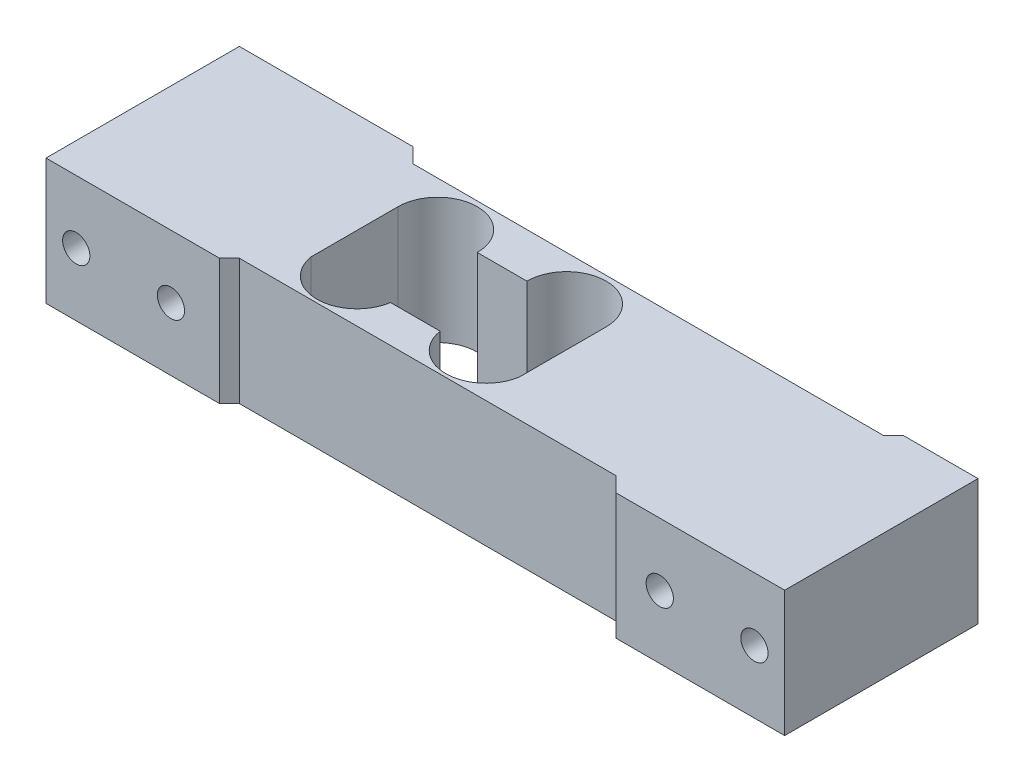
ISO-10303-21;
HEADER;
FILE_DESCRIPTION(('STEP AP214'),'2;1');
FILE_NAME('part.step','',(''),(''),'','','');
FILE_SCHEMA(('AUTOMOTIVE_DESIGN { 1 0 10303 214 1 1 1 1 }'));
ENDSEC;
DATA;
#1=APPLICATION_CONTEXT('core data for automotive mechanical design processes');
#2=APPLICATION_PROTOCOL_DEFINITION('international standard','automotive_design',2000,#1);
#3=PRODUCT_CONTEXT('',#1,'mechanical');
#4=PRODUCT('Part','Part','',(#3));
#5=PRODUCT_RELATED_PRODUCT_CATEGORY('part','',(#4));
#6=PRODUCT_DEFINITION_FORMATION('','',#4);
#7=PRODUCT_DEFINITION_CONTEXT('part definition',#1,'design');
#8=PRODUCT_DEFINITION('design','',#6,#7);
#9=PRODUCT_DEFINITION_SHAPE('','',#8);
#10=(LENGTH_UNIT() NAMED_UNIT(*) SI_UNIT(.MILLI.,.METRE.));
#11=(NAMED_UNIT(*) PLANE_ANGLE_UNIT() SI_UNIT($,.RADIAN.));
#12=(NAMED_UNIT(*) SI_UNIT($,.STERADIAN.) SOLID_ANGLE_UNIT());
#13=UNCERTAINTY_MEASURE_WITH_UNIT(LENGTH_MEASURE(1.E-05),#10,'distance_accuracy_value','');
#14=(GEOMETRIC_REPRESENTATION_CONTEXT(3) GLOBAL_UNCERTAINTY_ASSIGNED_CONTEXT((#13)) GLOBAL_UNIT_ASSIGNED_CONTEXT((#10,
#11,#12)) REPRESENTATION_CONTEXT('',''));
#15=CARTESIAN_POINT('',(0.,0.,0.));
#16=DIRECTION('',(0.,0.,1.));
#17=DIRECTION('',(1.,0.,0.));
#18=AXIS2_PLACEMENT_3D('',#15,#16,#17);
#19=CARTESIAN_POINT('',(-59.,12.7,9.05));
#20=DIRECTION('',(-1.,0.,0.));
#21=DIRECTION('',(0.,0.,1.));
#22=AXIS2_PLACEMENT_3D('',#19,#20,#21);
#23=CYLINDRICAL_SURFACE('',#22,2.75);
#24=CARTESIAN_POINT('',(-75.,12.7,9.05));
#25=DIRECTION('',(-1.,0.,0.));
#26=DIRECTION('',(0.,0.,1.));
#27=AXIS2_PLACEMENT_3D('',#24,#25,#26);
#28=CIRCLE('',#27,2.75);
#29=CARTESIAN_POINT('',(-75.,12.7,11.8));
#30=VERTEX_POINT('',#29);
#31=EDGE_CURVE('E281',#30,#30,#28,.T.);
#32=ORIENTED_EDGE('',*,*,#31,.T.);
#33=EDGE_LOOP('',(#32));
#34=FACE_BOUND('',#33,.T.);
#35=CARTESIAN_POINT('',(-68.9,12.7,9.05));
#36=DIRECTION('',(-0.707106781186547,0.,-0.707106781186547));
#37=DIRECTION('',(-0.707106781186547,0.,0.707106781186547));
#38=AXIS2_PLACEMENT_3D('',#35,#36,#37);
#39=ELLIPSE('',#38,3.88908729652602,2.75);
#40=CARTESIAN_POINT('',(-68.9,15.45,9.05));
#41=VERTEX_POINT('',#40);
#42=CARTESIAN_POINT('',(-68.9,9.95,9.05));
#43=VERTEX_POINT('',#42);
#44=EDGE_CURVE('E409',#41,#43,#39,.F.);
#45=ORIENTED_EDGE('',*,*,#44,.T.);
#46=CARTESIAN_POINT('',(-68.9,12.7,9.05));
#47=DIRECTION('',(-0.707106781186547,0.,0.707106781186547));
#48=DIRECTION('',(-0.707106781186547,0.,-0.707106781186547));
#49=AXIS2_PLACEMENT_3D('',#46,#47,#48);
#50=ELLIPSE('',#49,3.88908729652602,2.75);
#51=EDGE_CURVE('E11',#43,#41,#50,.F.);
#52=ORIENTED_EDGE('',*,*,#51,.T.);
#53=EDGE_LOOP('',(#45,#52));
#54=FACE_BOUND('',#53,.T.);
#55=ADVANCED_FACE('F35',(#34,#54),#23,.F.);
#56=CARTESIAN_POINT('',(-68.9,12.7,-4.));
#57=DIRECTION('',(0.,0.,-1.));
#58=DIRECTION('',(-1.,0.,0.));
#59=AXIS2_PLACEMENT_3D('',#56,#57,#58);
#60=CYLINDRICAL_SURFACE('',#59,2.75000000000001);
#61=CARTESIAN_POINT('',(-68.9,12.7,-20.));
#62=DIRECTION('',(0.,0.,-1.));
#63=DIRECTION('',(-1.,0.,0.));
#64=AXIS2_PLACEMENT_3D('',#61,#62,#63);
#65=CIRCLE('',#64,2.75000000000001);
#66=CARTESIAN_POINT('',(-71.65,12.7,-20.));
#67=VERTEX_POINT('',#66);
#68=EDGE_CURVE('E293',#67,#67,#65,.T.);
#69=ORIENTED_EDGE('',*,*,#68,.T.);
#70=EDGE_LOOP('',(#69));
#71=FACE_BOUND('',#70,.T.);
#72=CARTESIAN_POINT('',(-68.9,12.7,-10.05));
#73=DIRECTION('',(0.707106781186547,0.,-0.707106781186547));
#74=DIRECTION('',(-0.707106781186547,0.,-0.707106781186547));
#75=AXIS2_PLACEMENT_3D('',#72,#73,#74);
#76=ELLIPSE('',#75,3.88908729652602,2.75);
#77=CARTESIAN_POINT('',(-68.9,15.45,-10.05));
#78=VERTEX_POINT('',#77);
#79=CARTESIAN_POINT('',(-68.9,9.95,-10.05));
#80=VERTEX_POINT('',#79);
#81=EDGE_CURVE('E398',#78,#80,#76,.F.);
#82=ORIENTED_EDGE('',*,*,#81,.T.);
#83=CARTESIAN_POINT('',(-68.9,12.7,-10.05));
#84=DIRECTION('',(-0.707106781186547,0.,-0.707106781186547));
#85=DIRECTION('',(0.707106781186547,0.,-0.707106781186547));
#86=AXIS2_PLACEMENT_3D('',#83,#84,#85);
#87=ELLIPSE('',#86,3.88908729652602,2.75);
#88=EDGE_CURVE('E406',#80,#78,#87,.F.);
#89=ORIENTED_EDGE('',*,*,#88,.T.);
#90=EDGE_LOOP('',(#82,#89));
#91=FACE_BOUND('',#90,.T.);
#92=ADVANCED_FACE('F426',(#71,#91),#60,.F.);
#93=CARTESIAN_POINT('',(75.,25.4,-20.));
#94=DIRECTION('',(-1.,0.,0.));
#95=DIRECTION('',(0.,0.,1.));
#96=AXIS2_PLACEMENT_3D('',#93,#94,#95);
#97=PLANE('',#96);
#98=DIRECTION('',(0.,0.,-1.));
#99=VECTOR('',#98,1.);
#100=CARTESIAN_POINT('',(75.,0.,-20.));
#101=LINE('',#100,#99);
#102=CARTESIAN_POINT('',(75.,0.,20.));
#103=VERTEX_POINT('',#102);
#104=CARTESIAN_POINT('',(75.,0.,-19.));
#105=VERTEX_POINT('',#104);
#106=EDGE_CURVE('E316',#103,#105,#101,.T.);
#107=ORIENTED_EDGE('',*,*,#106,.T.);
#108=DIRECTION('',(0.,1.,0.));
#109=VECTOR('',#108,1.);
#110=CARTESIAN_POINT('',(75.,0.,-19.));
#111=LINE('',#110,#109);
#112=CARTESIAN_POINT('',(75.,25.4,-19.));
#113=VERTEX_POINT('',#112);
#114=EDGE_CURVE('E308',#105,#113,#111,.T.);
#115=ORIENTED_EDGE('',*,*,#114,.T.);
#116=DIRECTION('',(0.,0.,-1.));
#117=VECTOR('',#116,1.);
#118=CARTESIAN_POINT('',(75.,25.4,-20.));
#119=LINE('',#118,#117);
#120=CARTESIAN_POINT('',(75.,25.4,20.));
#121=VERTEX_POINT('',#120);
#122=EDGE_CURVE('E329',#121,#113,#119,.T.);
#123=ORIENTED_EDGE('',*,*,#122,.F.);
#124=DIRECTION('',(0.,-1.,0.));
#125=VECTOR('',#124,1.);
#126=CARTESIAN_POINT('',(75.,25.4,20.));
#127=LINE('',#126,#125);
#128=EDGE_CURVE('E340',#121,#103,#127,.T.);
#129=ORIENTED_EDGE('',*,*,#128,.T.);
#130=EDGE_LOOP('',(#107,#115,#123,#129));
#131=FACE_BOUND('',#130,.T.);
#132=ADVANCED_FACE('F432',(#131),#97,.F.);
#133=CARTESIAN_POINT('',(-75.,25.4,-20.));
#134=DIRECTION('',(0.,0.,1.));
#135=DIRECTION('',(1.,0.,0.));
#136=AXIS2_PLACEMENT_3D('',#133,#134,#135);
#137=PLANE('',#136);
#138=ORIENTED_EDGE('',*,*,#68,.F.);
#139=EDGE_LOOP('',(#138));
#140=FACE_BOUND('',#139,.T.);
#141=CARTESIAN_POINT('',(-49.8,12.7,-20.));
#142=DIRECTION('',(0.,0.,-1.));
#143=DIRECTION('',(-1.,0.,0.));
#144=AXIS2_PLACEMENT_3D('',#141,#142,#143);
#145=CIRCLE('',#144,2.75);
#146=CARTESIAN_POINT('',(-52.55,12.7,-20.));
#147=VERTEX_POINT('',#146);
#148=EDGE_CURVE('E280',#147,#147,#145,.T.);
#149=ORIENTED_EDGE('',*,*,#148,.F.);
#150=EDGE_LOOP('',(#149));
#151=FACE_BOUND('',#150,.T.);
#152=DIRECTION('',(-1.,0.,0.));
#153=VECTOR('',#152,1.);
#154=CARTESIAN_POINT('',(-75.,25.4,-20.));
#155=LINE('',#154,#153);
#156=CARTESIAN_POINT('',(-39.9999999999999,25.4,-20.));
#157=VERTEX_POINT('',#156);
#158=CARTESIAN_POINT('',(-75.,25.4,-20.));
#159=VERTEX_POINT('',#158);
#160=EDGE_CURVE('E332',#157,#159,#155,.T.);
#161=ORIENTED_EDGE('',*,*,#160,.F.);
#162=DIRECTION('',(0.,1.,0.));
#163=VECTOR('',#162,1.);
#164=CARTESIAN_POINT('',(-39.9999999999999,25.4,-20.));
#165=LINE('',#164,#163);
#166=CARTESIAN_POINT('',(-39.9999999999999,0.,-20.));
#167=VERTEX_POINT('',#166);
#168=EDGE_CURVE('E371',#157,#167,#165,.F.);
#169=ORIENTED_EDGE('',*,*,#168,.T.);
#170=DIRECTION('',(-1.,0.,0.));
#171=VECTOR('',#170,1.);
#172=CARTESIAN_POINT('',(-75.,0.,-20.));
#173=LINE('',#172,#171);
#174=CARTESIAN_POINT('',(-75.,0.,-20.));
#175=VERTEX_POINT('',#174);
#176=EDGE_CURVE('E343',#167,#175,#173,.T.);
#177=ORIENTED_EDGE('',*,*,#176,.T.);
#178=DIRECTION('',(0.,-1.,0.));
#179=VECTOR('',#178,1.);
#180=CARTESIAN_POINT('',(-75.,25.4,-20.));
#181=LINE('',#180,#179);
#182=EDGE_CURVE('E351',#159,#175,#181,.T.);
#183=ORIENTED_EDGE('',*,*,#182,.F.);
#184=EDGE_LOOP('',(#161,#169,#177,#183));
#185=FACE_BOUND('',#184,.T.);
#186=ADVANCED_FACE('F545',(#140,#151,#185),#137,.F.);
#187=CARTESIAN_POINT('',(-75.,25.4,-20.));
#188=DIRECTION('',(1.,0.,0.));
#189=DIRECTION('',(0.,0.,-1.));
#190=AXIS2_PLACEMENT_3D('',#187,#188,#189);
#191=PLANE('',#190);
#192=ORIENTED_EDGE('',*,*,#31,.F.);
#193=EDGE_LOOP('',(#192));
#194=FACE_BOUND('',#193,.T.);
#195=CARTESIAN_POINT('',(-75.,12.7,-10.05));
#196=DIRECTION('',(-1.,0.,0.));
#197=DIRECTION('',(0.,0.,1.));
#198=AXIS2_PLACEMENT_3D('',#195,#196,#197);
#199=CIRCLE('',#198,2.75);
#200=CARTESIAN_POINT('',(-75.,12.7,-7.3));
#201=VERTEX_POINT('',#200);
#202=EDGE_CURVE('E268',#201,#201,#199,.T.);
#203=ORIENTED_EDGE('',*,*,#202,.F.);
#204=EDGE_LOOP('',(#203));
#205=FACE_BOUND('',#204,.T.);
#206=DIRECTION('',(0.,0.,1.));
#207=VECTOR('',#206,1.);
#208=CARTESIAN_POINT('',(-75.,0.,-20.));
#209=LINE('',#208,#207);
#210=CARTESIAN_POINT('',(-75.,0.,19.));
#211=VERTEX_POINT('',#210);
#212=EDGE_CURVE('E345',#175,#211,#209,.T.);
#213=ORIENTED_EDGE('',*,*,#212,.T.);
#214=DIRECTION('',(0.,1.,0.));
#215=VECTOR('',#214,1.);
#216=CARTESIAN_POINT('',(-75.,0.,19.));
#217=LINE('',#216,#215);
#218=CARTESIAN_POINT('',(-75.,25.4,19.));
#219=VERTEX_POINT('',#218);
#220=EDGE_CURVE('E312',#211,#219,#217,.T.);
#221=ORIENTED_EDGE('',*,*,#220,.T.);
#222=DIRECTION('',(0.,0.,1.));
#223=VECTOR('',#222,1.);
#224=CARTESIAN_POINT('',(-75.,25.4,-20.));
#225=LINE('',#224,#223);
#226=EDGE_CURVE('E335',#159,#219,#225,.T.);
#227=ORIENTED_EDGE('',*,*,#226,.F.);
#228=ORIENTED_EDGE('',*,*,#182,.T.);
#229=EDGE_LOOP('',(#213,#221,#227,#228));
#230=FACE_BOUND('',#229,.T.);
#231=ADVANCED_FACE('F547',(#194,#205,#230),#191,.F.);
#232=CARTESIAN_POINT('',(-75.,25.4,20.));
#233=DIRECTION('',(0.,0.,-1.));
#234=DIRECTION('',(-1.,0.,0.));
#235=AXIS2_PLACEMENT_3D('',#232,#233,#234);
#236=PLANE('',#235);
#237=CARTESIAN_POINT('',(49.8,12.7,20.));
#238=DIRECTION('',(0.,0.,1.));
#239=DIRECTION('',(1.,0.,0.));
#240=AXIS2_PLACEMENT_3D('',#237,#238,#239);
#241=CIRCLE('',#240,2.75);
#242=CARTESIAN_POINT('',(52.55,12.7,20.));
#243=VERTEX_POINT('',#242);
#244=EDGE_CURVE('E257',#243,#243,#241,.T.);
#245=ORIENTED_EDGE('',*,*,#244,.F.);
#246=EDGE_LOOP('',(#245));
#247=FACE_BOUND('',#246,.T.);
#248=CARTESIAN_POINT('',(68.9,12.7,20.));
#249=DIRECTION('',(0.,0.,1.));
#250=DIRECTION('',(1.,0.,0.));
#251=AXIS2_PLACEMENT_3D('',#248,#249,#250);
#252=CIRCLE('',#251,2.75000000000001);
#253=CARTESIAN_POINT('',(71.65,12.7,20.));
#254=VERTEX_POINT('',#253);
#255=EDGE_CURVE('E241',#254,#254,#252,.T.);
#256=ORIENTED_EDGE('',*,*,#255,.F.);
#257=EDGE_LOOP('',(#256));
#258=FACE_BOUND('',#257,.T.);
#259=DIRECTION('',(1.,0.,0.));
#260=VECTOR('',#259,1.);
#261=CARTESIAN_POINT('',(-75.,25.4,20.));
#262=LINE('',#261,#260);
#263=CARTESIAN_POINT('',(40.9999999999999,25.4,20.));
#264=VERTEX_POINT('',#263);
#265=EDGE_CURVE('E338',#264,#121,#262,.T.);
#266=ORIENTED_EDGE('',*,*,#265,.F.);
#267=DIRECTION('',(0.,1.,0.));
#268=VECTOR('',#267,1.);
#269=CARTESIAN_POINT('',(40.9999999999999,25.4,20.));
#270=LINE('',#269,#268);
#271=CARTESIAN_POINT('',(40.9999999999999,0.,20.));
#272=VERTEX_POINT('',#271);
#273=EDGE_CURVE('E363',#264,#272,#270,.F.);
#274=ORIENTED_EDGE('',*,*,#273,.T.);
#275=DIRECTION('',(1.,0.,0.));
#276=VECTOR('',#275,1.);
#277=CARTESIAN_POINT('',(-75.,0.,20.));
#278=LINE('',#277,#276);
#279=EDGE_CURVE('E333',#272,#103,#278,.T.);
#280=ORIENTED_EDGE('',*,*,#279,.T.);
#281=ORIENTED_EDGE('',*,*,#128,.F.);
#282=EDGE_LOOP('',(#266,#274,#280,#281));
#283=FACE_BOUND('',#282,.T.);
#284=ADVANCED_FACE('F523',(#247,#258,#283),#236,.F.);
#285=CARTESIAN_POINT('',(0.,25.4,0.));
#286=DIRECTION('',(0.,1.,0.));
#287=DIRECTION('',(0.,0.,1.));
#288=AXIS2_PLACEMENT_3D('',#285,#286,#287);
#289=PLANE('',#288);
#290=CARTESIAN_POINT('',(3.00000000000001,25.4,-8.));
#291=DIRECTION('',(0.,1.,0.));
#292=DIRECTION('',(0.,0.,1.));
#293=AXIS2_PLACEMENT_3D('',#290,#291,#292);
#294=CIRCLE('',#293,7.99999999999999);
#295=CARTESIAN_POINT('',(11.,25.4,-8.));
#296=VERTEX_POINT('',#295);
#297=CARTESIAN_POINT('',(-4.99999999999999,25.4,-8.));
#298=VERTEX_POINT('',#297);
#299=EDGE_CURVE('E50',#296,#298,#294,.T.);
#300=ORIENTED_EDGE('',*,*,#299,.F.);
#301=DIRECTION('',(0.,0.,-1.));
#302=VECTOR('',#301,1.);
#303=CARTESIAN_POINT('',(11.,25.4,9.5));
#304=LINE('',#303,#302);
#305=CARTESIAN_POINT('',(11.,25.4,9.50000000000001));
#306=VERTEX_POINT('',#305);
#307=EDGE_CURVE('E203',#306,#296,#304,.T.);
#308=ORIENTED_EDGE('',*,*,#307,.F.);
#309=CARTESIAN_POINT('',(3.00000000000001,25.4,8.2527426));
#310=DIRECTION('',(0.,1.,0.));
#311=DIRECTION('',(0.,0.,1.));
#312=AXIS2_PLACEMENT_3D('',#309,#310,#311);
#313=CIRCLE('',#312,8.09664442975328);
#314=CARTESIAN_POINT('',(-4.99999999999999,25.4,9.5));
#315=VERTEX_POINT('',#314);
#316=EDGE_CURVE('E206',#315,#306,#313,.T.);
#317=ORIENTED_EDGE('',*,*,#316,.F.);
#318=DIRECTION('',(1.,0.,0.));
#319=VECTOR('',#318,1.);
#320=CARTESIAN_POINT('',(-15.,25.4,9.5));
#321=LINE('',#320,#319);
#322=CARTESIAN_POINT('',(-15.,25.4,9.50000000000001));
#323=VERTEX_POINT('',#322);
#324=EDGE_CURVE('E234',#323,#315,#321,.T.);
#325=ORIENTED_EDGE('',*,*,#324,.F.);
#326=CARTESIAN_POINT('',(-23.,25.4,8.25274262759437));
#327=DIRECTION('',(0.,1.,0.));
#328=DIRECTION('',(0.,0.,1.));
#329=AXIS2_PLACEMENT_3D('',#326,#327,#328);
#330=CIRCLE('',#329,8.09664442550247);
#331=CARTESIAN_POINT('',(-31.,25.4,9.5));
#332=VERTEX_POINT('',#331);
#333=EDGE_CURVE('E231',#332,#323,#330,.T.);
#334=ORIENTED_EDGE('',*,*,#333,.F.);
#335=DIRECTION('',(0.,0.,1.));
#336=VECTOR('',#335,1.);
#337=CARTESIAN_POINT('',(-31.,25.4,-8.));
#338=LINE('',#337,#336);
#339=CARTESIAN_POINT('',(-31.,25.4,-8.));
#340=VERTEX_POINT('',#339);
#341=EDGE_CURVE('E228',#340,#332,#338,.T.);
#342=ORIENTED_EDGE('',*,*,#341,.F.);
#343=CARTESIAN_POINT('',(-23.,25.4,-8.));
#344=DIRECTION('',(0.,1.,0.));
#345=DIRECTION('',(0.,0.,1.));
#346=AXIS2_PLACEMENT_3D('',#343,#344,#345);
#347=CIRCLE('',#346,8.);
#348=CARTESIAN_POINT('',(-15.,25.4,-8.));
#349=VERTEX_POINT('',#348);
#350=EDGE_CURVE('E225',#349,#340,#347,.T.);
#351=ORIENTED_EDGE('',*,*,#350,.F.);
#352=DIRECTION('',(-1.,0.,0.));
#353=VECTOR('',#352,1.);
#354=CARTESIAN_POINT('',(-15.,25.4,-8.));
#355=LINE('',#354,#353);
#356=EDGE_CURVE('E223',#298,#349,#355,.T.);
#357=ORIENTED_EDGE('',*,*,#356,.F.);
#358=EDGE_LOOP('',(#300,#308,#317,#325,#334,#342,#351,#357));
#359=FACE_BOUND('',#358,.T.);
#360=DIRECTION('',(1.,0.,0.));
#361=VECTOR('',#360,1.);
#362=CARTESIAN_POINT('',(61.,25.4,-19.));
#363=LINE('',#362,#361);
#364=CARTESIAN_POINT('',(60.,25.4,-19.));
#365=VERTEX_POINT('',#364);
#366=EDGE_CURVE('E305',#365,#113,#363,.T.);
#367=ORIENTED_EDGE('',*,*,#366,.F.);
#368=DIRECTION('',(0.707106781186543,0.,-0.707106781186552));
#369=VECTOR('',#368,1.);
#370=CARTESIAN_POINT('',(61.,25.4,-20.0000000000001));
#371=LINE('',#370,#369);
#372=CARTESIAN_POINT('',(58.,25.4,-17.));
#373=VERTEX_POINT('',#372);
#374=EDGE_CURVE('E393',#365,#373,#371,.F.);
#375=ORIENTED_EDGE('',*,*,#374,.T.);
#376=DIRECTION('',(1.,0.,0.));
#377=VECTOR('',#376,1.);
#378=CARTESIAN_POINT('',(-42.,25.4,-17.));
#379=LINE('',#378,#377);
#380=CARTESIAN_POINT('',(-36.9999999999999,25.4,-17.));
#381=VERTEX_POINT('',#380);
#382=EDGE_CURVE('E309',#381,#373,#379,.T.);
#383=ORIENTED_EDGE('',*,*,#382,.F.);
#384=DIRECTION('',(0.707106781186551,0.,0.707106781186544));
#385=VECTOR('',#384,1.);
#386=CARTESIAN_POINT('',(-36.9999999999999,25.4,-17.));
#387=LINE('',#386,#385);
#388=EDGE_CURVE('E368',#381,#157,#387,.F.);
#389=ORIENTED_EDGE('',*,*,#388,.T.);
#390=ORIENTED_EDGE('',*,*,#160,.T.);
#391=ORIENTED_EDGE('',*,*,#226,.T.);
#392=DIRECTION('',(-1.,0.,0.));
#393=VECTOR('',#392,1.);
#394=CARTESIAN_POINT('',(-41.,25.4,19.));
#395=LINE('',#394,#393);
#396=CARTESIAN_POINT('',(-39.9999999999999,25.4,19.));
#397=VERTEX_POINT('',#396);
#398=EDGE_CURVE('E321',#397,#219,#395,.T.);
#399=ORIENTED_EDGE('',*,*,#398,.F.);
#400=DIRECTION('',(-0.707106781186545,0.,0.70710678118655));
#401=VECTOR('',#400,1.);
#402=CARTESIAN_POINT('',(-41.,25.4,20.0000000000001));
#403=LINE('',#402,#401);
#404=CARTESIAN_POINT('',(-38.,25.4,17.));
#405=VERTEX_POINT('',#404);
#406=EDGE_CURVE('E385',#397,#405,#403,.F.);
#407=ORIENTED_EDGE('',*,*,#406,.T.);
#408=DIRECTION('',(-1.,0.,0.));
#409=VECTOR('',#408,1.);
#410=CARTESIAN_POINT('',(43.,25.4,17.));
#411=LINE('',#410,#409);
#412=CARTESIAN_POINT('',(37.9999999999999,25.4,17.));
#413=VERTEX_POINT('',#412);
#414=EDGE_CURVE('E292',#413,#405,#411,.T.);
#415=ORIENTED_EDGE('',*,*,#414,.F.);
#416=DIRECTION('',(-0.707106781186551,0.,-0.707106781186544));
#417=VECTOR('',#416,1.);
#418=CARTESIAN_POINT('',(37.9999999999999,25.4,17.));
#419=LINE('',#418,#417);
#420=EDGE_CURVE('E360',#413,#264,#419,.F.);
#421=ORIENTED_EDGE('',*,*,#420,.T.);
#422=ORIENTED_EDGE('',*,*,#265,.T.);
#423=ORIENTED_EDGE('',*,*,#122,.T.);
#424=EDGE_LOOP('',(#367,#375,#383,#389,#390,#391,#399,#407,#415,#421,#422,#423));
#425=FACE_BOUND('',#424,.T.);
#426=ADVANCED_FACE('F512',(#359,#425),#289,.T.);
#427=CARTESIAN_POINT('',(0.,0.,0.));
#428=DIRECTION('',(0.,1.,0.));
#429=DIRECTION('',(0.,0.,1.));
#430=AXIS2_PLACEMENT_3D('',#427,#428,#429);
#431=PLANE('',#430);
#432=DIRECTION('',(0.,0.,-1.));
#433=VECTOR('',#432,1.);
#434=CARTESIAN_POINT('',(11.,0.,9.5));
#435=LINE('',#434,#433);
#436=CARTESIAN_POINT('',(11.,0.,9.50000000000001));
#437=VERTEX_POINT('',#436);
#438=CARTESIAN_POINT('',(11.,0.,-8.));
#439=VERTEX_POINT('',#438);
#440=EDGE_CURVE('E192',#437,#439,#435,.T.);
#441=ORIENTED_EDGE('',*,*,#440,.T.);
#442=CARTESIAN_POINT('',(3.00000000000001,0.,-8.));
#443=DIRECTION('',(0.,1.,0.));
#444=DIRECTION('',(0.,0.,1.));
#445=AXIS2_PLACEMENT_3D('',#442,#443,#444);
#446=CIRCLE('',#445,7.99999999999999);
#447=CARTESIAN_POINT('',(-4.99999999999999,0.,-8.));
#448=VERTEX_POINT('',#447);
#449=EDGE_CURVE('E186',#439,#448,#446,.T.);
#450=ORIENTED_EDGE('',*,*,#449,.T.);
#451=DIRECTION('',(-1.,0.,0.));
#452=VECTOR('',#451,1.);
#453=CARTESIAN_POINT('',(-15.,0.,-8.));
#454=LINE('',#453,#452);
#455=CARTESIAN_POINT('',(-15.,0.,-8.));
#456=VERTEX_POINT('',#455);
#457=EDGE_CURVE('E195',#448,#456,#454,.T.);
#458=ORIENTED_EDGE('',*,*,#457,.T.);
#459=CARTESIAN_POINT('',(-23.,0.,-8.));
#460=DIRECTION('',(0.,1.,0.));
#461=DIRECTION('',(0.,0.,1.));
#462=AXIS2_PLACEMENT_3D('',#459,#460,#461);
#463=CIRCLE('',#462,8.);
#464=CARTESIAN_POINT('',(-31.,0.,-8.));
#465=VERTEX_POINT('',#464);
#466=EDGE_CURVE('E58',#456,#465,#463,.T.);
#467=ORIENTED_EDGE('',*,*,#466,.T.);
#468=DIRECTION('',(0.,0.,1.));
#469=VECTOR('',#468,1.);
#470=CARTESIAN_POINT('',(-31.,0.,-8.));
#471=LINE('',#470,#469);
#472=CARTESIAN_POINT('',(-31.,0.,9.5));
#473=VERTEX_POINT('',#472);
#474=EDGE_CURVE('E210',#465,#473,#471,.T.);
#475=ORIENTED_EDGE('',*,*,#474,.T.);
#476=CARTESIAN_POINT('',(-23.,0.,8.25274262759437));
#477=DIRECTION('',(0.,1.,0.));
#478=DIRECTION('',(0.,0.,1.));
#479=AXIS2_PLACEMENT_3D('',#476,#477,#478);
#480=CIRCLE('',#479,8.09664442550247);
#481=CARTESIAN_POINT('',(-15.,0.,9.50000000000001));
#482=VERTEX_POINT('',#481);
#483=EDGE_CURVE('E213',#473,#482,#480,.T.);
#484=ORIENTED_EDGE('',*,*,#483,.T.);
#485=DIRECTION('',(1.,0.,0.));
#486=VECTOR('',#485,1.);
#487=CARTESIAN_POINT('',(-15.,0.,9.5));
#488=LINE('',#487,#486);
#489=CARTESIAN_POINT('',(-4.99999999999999,0.,9.5));
#490=VERTEX_POINT('',#489);
#491=EDGE_CURVE('E216',#482,#490,#488,.T.);
#492=ORIENTED_EDGE('',*,*,#491,.T.);
#493=CARTESIAN_POINT('',(3.00000000000001,0.,8.2527426));
#494=DIRECTION('',(0.,1.,0.));
#495=DIRECTION('',(0.,0.,1.));
#496=AXIS2_PLACEMENT_3D('',#493,#494,#495);
#497=CIRCLE('',#496,8.09664442975328);
#498=EDGE_CURVE('E219',#490,#437,#497,.T.);
#499=ORIENTED_EDGE('',*,*,#498,.T.);
#500=EDGE_LOOP('',(#441,#450,#458,#467,#475,#484,#492,#499));
#501=FACE_BOUND('',#500,.T.);
#502=DIRECTION('',(1.,0.,0.));
#503=VECTOR('',#502,1.);
#504=CARTESIAN_POINT('',(-42.,0.,-17.));
#505=LINE('',#504,#503);
#506=CARTESIAN_POINT('',(-36.9999999999999,0.,-17.));
#507=VERTEX_POINT('',#506);
#508=CARTESIAN_POINT('',(58.,0.,-17.));
#509=VERTEX_POINT('',#508);
#510=EDGE_CURVE('E301',#507,#509,#505,.T.);
#511=ORIENTED_EDGE('',*,*,#510,.T.);
#512=DIRECTION('',(-0.707106781186543,0.,0.707106781186552));
#513=VECTOR('',#512,1.);
#514=CARTESIAN_POINT('',(20.5000000000003,0.,20.5000000000001));
#515=LINE('',#514,#513);
#516=CARTESIAN_POINT('',(60.,0.,-19.));
#517=VERTEX_POINT('',#516);
#518=EDGE_CURVE('E395',#509,#517,#515,.F.);
#519=ORIENTED_EDGE('',*,*,#518,.T.);
#520=DIRECTION('',(1.,0.,0.));
#521=VECTOR('',#520,1.);
#522=CARTESIAN_POINT('',(61.,0.,-19.));
#523=LINE('',#522,#521);
#524=EDGE_CURVE('E304',#517,#105,#523,.T.);
#525=ORIENTED_EDGE('',*,*,#524,.T.);
#526=ORIENTED_EDGE('',*,*,#106,.F.);
#527=ORIENTED_EDGE('',*,*,#279,.F.);
#528=DIRECTION('',(0.707106781186551,0.,0.707106781186544));
#529=VECTOR('',#528,1.);
#530=CARTESIAN_POINT('',(10.4999999999998,0.,-10.4999999999999));
#531=LINE('',#530,#529);
#532=CARTESIAN_POINT('',(37.9999999999999,0.,17.));
#533=VERTEX_POINT('',#532);
#534=EDGE_CURVE('E366',#272,#533,#531,.F.);
#535=ORIENTED_EDGE('',*,*,#534,.T.);
#536=DIRECTION('',(-1.,0.,0.));
#537=VECTOR('',#536,1.);
#538=CARTESIAN_POINT('',(43.,0.,17.));
#539=LINE('',#538,#537);
#540=CARTESIAN_POINT('',(-38.,0.,17.));
#541=VERTEX_POINT('',#540);
#542=EDGE_CURVE('E317',#533,#541,#539,.T.);
#543=ORIENTED_EDGE('',*,*,#542,.T.);
#544=DIRECTION('',(0.707106781186545,0.,-0.70710678118655));
#545=VECTOR('',#544,1.);
#546=CARTESIAN_POINT('',(-10.5000000000001,0.,-10.5));
#547=LINE('',#546,#545);
#548=CARTESIAN_POINT('',(-39.9999999999999,0.,19.));
#549=VERTEX_POINT('',#548);
#550=EDGE_CURVE('E387',#541,#549,#547,.F.);
#551=ORIENTED_EDGE('',*,*,#550,.T.);
#552=DIRECTION('',(-1.,0.,0.));
#553=VECTOR('',#552,1.);
#554=CARTESIAN_POINT('',(-41.,0.,19.));
#555=LINE('',#554,#553);
#556=EDGE_CURVE('E320',#549,#211,#555,.T.);
#557=ORIENTED_EDGE('',*,*,#556,.T.);
#558=ORIENTED_EDGE('',*,*,#212,.F.);
#559=ORIENTED_EDGE('',*,*,#176,.F.);
#560=DIRECTION('',(-0.707106781186551,0.,-0.707106781186544));
#561=VECTOR('',#560,1.);
#562=CARTESIAN_POINT('',(-9.99999999999976,0.,9.99999999999986));
#563=LINE('',#562,#561);
#564=EDGE_CURVE('E374',#167,#507,#563,.F.);
#565=ORIENTED_EDGE('',*,*,#564,.T.);
#566=EDGE_LOOP('',(#511,#519,#525,#526,#527,#535,#543,#551,#557,#558,#559,#565));
#567=FACE_BOUND('',#566,.T.);
#568=ADVANCED_FACE('F199',(#501,#567),#431,.F.);
#569=CARTESIAN_POINT('',(-41.,0.,19.));
#570=DIRECTION('',(0.,0.,-1.));
#571=DIRECTION('',(-1.,0.,0.));
#572=AXIS2_PLACEMENT_3D('',#569,#570,#571);
#573=PLANE('',#572);
#574=CARTESIAN_POINT('',(-68.9,12.7,19.));
#575=DIRECTION('',(0.,0.,1.));
#576=DIRECTION('',(1.,0.,0.));
#577=AXIS2_PLACEMENT_3D('',#574,#575,#576);
#578=CIRCLE('',#577,2.75000000000001);
#579=CARTESIAN_POINT('',(-66.15,12.7,19.));
#580=VERTEX_POINT('',#579);
#581=EDGE_CURVE('E269',#580,#580,#578,.T.);
#582=ORIENTED_EDGE('',*,*,#581,.F.);
#583=EDGE_LOOP('',(#582));
#584=FACE_BOUND('',#583,.T.);
#585=CARTESIAN_POINT('',(-49.8,12.7,19.));
#586=DIRECTION('',(0.,0.,1.));
#587=DIRECTION('',(1.,0.,0.));
#588=AXIS2_PLACEMENT_3D('',#585,#586,#587);
#589=CIRCLE('',#588,2.75);
#590=CARTESIAN_POINT('',(-47.05,12.7,19.));
#591=VERTEX_POINT('',#590);
#592=EDGE_CURVE('E256',#591,#591,#589,.T.);
#593=ORIENTED_EDGE('',*,*,#592,.F.);
#594=EDGE_LOOP('',(#593));
#595=FACE_BOUND('',#594,.T.);
#596=ORIENTED_EDGE('',*,*,#398,.T.);
#597=ORIENTED_EDGE('',*,*,#220,.F.);
#598=ORIENTED_EDGE('',*,*,#556,.F.);
#599=DIRECTION('',(0.,-1.,0.));
#600=VECTOR('',#599,1.);
#601=CARTESIAN_POINT('',(-39.9999999999999,0.,19.));
#602=LINE('',#601,#600);
#603=EDGE_CURVE('E382',#549,#397,#602,.F.);
#604=ORIENTED_EDGE('',*,*,#603,.T.);
#605=EDGE_LOOP('',(#596,#597,#598,#604));
#606=FACE_BOUND('',#605,.T.);
#607=ADVANCED_FACE('F549',(#584,#595,#606),#573,.F.);
#608=CARTESIAN_POINT('',(43.,0.,17.));
#609=DIRECTION('',(0.,0.,-1.));
#610=DIRECTION('',(-1.,0.,0.));
#611=AXIS2_PLACEMENT_3D('',#608,#609,#610);
#612=PLANE('',#611);
#613=ORIENTED_EDGE('',*,*,#414,.T.);
#614=DIRECTION('',(0.,-1.,0.));
#615=VECTOR('',#614,1.);
#616=CARTESIAN_POINT('',(-38.,0.,17.));
#617=LINE('',#616,#615);
#618=EDGE_CURVE('E376',#405,#541,#617,.T.);
#619=ORIENTED_EDGE('',*,*,#618,.T.);
#620=ORIENTED_EDGE('',*,*,#542,.F.);
#621=DIRECTION('',(0.,1.,0.));
#622=VECTOR('',#621,1.);
#623=CARTESIAN_POINT('',(37.9999999999999,25.4,17.));
#624=LINE('',#623,#622);
#625=EDGE_CURVE('E354',#533,#413,#624,.T.);
#626=ORIENTED_EDGE('',*,*,#625,.T.);
#627=EDGE_LOOP('',(#613,#619,#620,#626));
#628=FACE_BOUND('',#627,.T.);
#629=ADVANCED_FACE('F558',(#628),#612,.F.);
#630=CARTESIAN_POINT('',(61.,0.,-19.));
#631=DIRECTION('',(0.,0.,1.));
#632=DIRECTION('',(1.,0.,0.));
#633=AXIS2_PLACEMENT_3D('',#630,#631,#632);
#634=PLANE('',#633);
#635=ORIENTED_EDGE('',*,*,#366,.T.);
#636=ORIENTED_EDGE('',*,*,#114,.F.);
#637=ORIENTED_EDGE('',*,*,#524,.F.);
#638=DIRECTION('',(0.,-1.,0.));
#639=VECTOR('',#638,1.);
#640=CARTESIAN_POINT('',(60.,0.,-19.));
#641=LINE('',#640,#639);
#642=EDGE_CURVE('E390',#517,#365,#641,.F.);
#643=ORIENTED_EDGE('',*,*,#642,.T.);
#644=EDGE_LOOP('',(#635,#636,#637,#643));
#645=FACE_BOUND('',#644,.T.);
#646=ADVANCED_FACE('F530',(#645),#634,.F.);
#647=CARTESIAN_POINT('',(-42.,0.,-17.));
#648=DIRECTION('',(0.,0.,1.));
#649=DIRECTION('',(1.,0.,0.));
#650=AXIS2_PLACEMENT_3D('',#647,#648,#649);
#651=PLANE('',#650);
#652=ORIENTED_EDGE('',*,*,#382,.T.);
#653=DIRECTION('',(0.,-1.,0.));
#654=VECTOR('',#653,1.);
#655=CARTESIAN_POINT('',(58.,0.,-17.));
#656=LINE('',#655,#654);
#657=EDGE_CURVE('E379',#373,#509,#656,.T.);
#658=ORIENTED_EDGE('',*,*,#657,.T.);
#659=ORIENTED_EDGE('',*,*,#510,.F.);
#660=DIRECTION('',(0.,1.,0.));
#661=VECTOR('',#660,1.);
#662=CARTESIAN_POINT('',(-36.9999999999999,25.4,-17.));
#663=LINE('',#662,#661);
#664=EDGE_CURVE('E357',#507,#381,#663,.T.);
#665=ORIENTED_EDGE('',*,*,#664,.T.);
#666=EDGE_LOOP('',(#652,#658,#659,#665));
#667=FACE_BOUND('',#666,.T.);
#668=ADVANCED_FACE('F535',(#667),#651,.F.);
#669=CARTESIAN_POINT('',(37.9999999999999,0.,17.));
#670=DIRECTION('',(-0.707106781186544,0.,0.707106781186551));
#671=DIRECTION('',(0.,-1.,0.));
#672=AXIS2_PLACEMENT_3D('',#669,#670,#671);
#673=PLANE('',#672);
#674=ORIENTED_EDGE('',*,*,#534,.F.);
#675=ORIENTED_EDGE('',*,*,#273,.F.);
#676=ORIENTED_EDGE('',*,*,#420,.F.);
#677=ORIENTED_EDGE('',*,*,#625,.F.);
#678=EDGE_LOOP('',(#674,#675,#676,#677));
#679=FACE_BOUND('',#678,.T.);
#680=ADVANCED_FACE('F562',(#679),#673,.T.);
#681=CARTESIAN_POINT('',(-36.9999999999999,0.,-17.));
#682=DIRECTION('',(0.707106781186544,0.,-0.707106781186551));
#683=DIRECTION('',(0.,-1.,0.));
#684=AXIS2_PLACEMENT_3D('',#681,#682,#683);
#685=PLANE('',#684);
#686=ORIENTED_EDGE('',*,*,#564,.F.);
#687=ORIENTED_EDGE('',*,*,#168,.F.);
#688=ORIENTED_EDGE('',*,*,#388,.F.);
#689=ORIENTED_EDGE('',*,*,#664,.F.);
#690=EDGE_LOOP('',(#686,#687,#688,#689));
#691=FACE_BOUND('',#690,.T.);
#692=ADVANCED_FACE('F541',(#691),#685,.T.);
#693=CARTESIAN_POINT('',(-41.,0.,20.0000000000001));
#694=DIRECTION('',(0.70710678118655,0.,0.707106781186545));
#695=DIRECTION('',(0.,-1.,0.));
#696=AXIS2_PLACEMENT_3D('',#693,#694,#695);
#697=PLANE('',#696);
#698=ORIENTED_EDGE('',*,*,#550,.F.);
#699=ORIENTED_EDGE('',*,*,#618,.F.);
#700=ORIENTED_EDGE('',*,*,#406,.F.);
#701=ORIENTED_EDGE('',*,*,#603,.F.);
#702=EDGE_LOOP('',(#698,#699,#700,#701));
#703=FACE_BOUND('',#702,.T.);
#704=ADVANCED_FACE('F555',(#703),#697,.T.);
#705=CARTESIAN_POINT('',(61.,0.,-20.0000000000001));
#706=DIRECTION('',(-0.707106781186552,0.,-0.707106781186543));
#707=DIRECTION('',(0.,-1.,0.));
#708=AXIS2_PLACEMENT_3D('',#705,#706,#707);
#709=PLANE('',#708);
#710=ORIENTED_EDGE('',*,*,#518,.F.);
#711=ORIENTED_EDGE('',*,*,#657,.F.);
#712=ORIENTED_EDGE('',*,*,#374,.F.);
#713=ORIENTED_EDGE('',*,*,#642,.F.);
#714=EDGE_LOOP('',(#710,#711,#712,#713));
#715=FACE_BOUND('',#714,.T.);
#716=ADVANCED_FACE('F37',(#715),#709,.T.);
#717=CARTESIAN_POINT('',(-49.8,12.7,-4.));
#718=DIRECTION('',(0.,0.,-1.));
#719=DIRECTION('',(-1.,0.,0.));
#720=AXIS2_PLACEMENT_3D('',#717,#718,#719);
#721=CYLINDRICAL_SURFACE('',#720,2.75);
#722=CARTESIAN_POINT('',(-49.8,12.7,-4.));
#723=DIRECTION('',(0.,0.,-1.));
#724=DIRECTION('',(-1.,0.,0.));
#725=AXIS2_PLACEMENT_3D('',#722,#723,#724);
#726=CIRCLE('',#725,2.75);
#727=CARTESIAN_POINT('',(-52.55,12.7,-4.));
#728=VERTEX_POINT('',#727);
#729=EDGE_CURVE('E296',#728,#728,#726,.T.);
#730=ORIENTED_EDGE('',*,*,#729,.F.);
#731=EDGE_LOOP('',(#730));
#732=FACE_BOUND('',#731,.T.);
#733=ORIENTED_EDGE('',*,*,#148,.T.);
#734=EDGE_LOOP('',(#733));
#735=FACE_BOUND('',#734,.T.);
#736=ADVANCED_FACE('F584',(#732,#735),#721,.F.);
#737=CARTESIAN_POINT('',(-49.8,12.7,-4.));
#738=DIRECTION('',(0.,0.,-1.));
#739=DIRECTION('',(-1.,0.,0.));
#740=AXIS2_PLACEMENT_3D('',#737,#738,#739);
#741=PLANE('',#740);
#742=ORIENTED_EDGE('',*,*,#729,.T.);
#743=EDGE_LOOP('',(#742));
#744=FACE_BOUND('',#743,.T.);
#745=ADVANCED_FACE('F588',(#744),#741,.T.);
#746=CARTESIAN_POINT('',(-59.,12.7,-10.05));
#747=DIRECTION('',(-1.,0.,0.));
#748=DIRECTION('',(0.,0.,1.));
#749=AXIS2_PLACEMENT_3D('',#746,#747,#748);
#750=CYLINDRICAL_SURFACE('',#749,2.75);
#751=ORIENTED_EDGE('',*,*,#202,.T.);
#752=EDGE_LOOP('',(#751));
#753=FACE_BOUND('',#752,.T.);
#754=ORIENTED_EDGE('',*,*,#81,.F.);
#755=CARTESIAN_POINT('',(-68.9,12.7,-10.05));
#756=DIRECTION('',(-0.707106781186547,0.,-0.707106781186547));
#757=DIRECTION('',(0.707106781186547,0.,-0.707106781186547));
#758=AXIS2_PLACEMENT_3D('',#755,#756,#757);
#759=ELLIPSE('',#758,3.88908729652602,2.75);
#760=EDGE_CURVE('E403',#80,#78,#759,.T.);
#761=ORIENTED_EDGE('',*,*,#760,.F.);
#762=EDGE_LOOP('',(#754,#761));
#763=FACE_BOUND('',#762,.T.);
#764=ADVANCED_FACE('F594',(#753,#763),#750,.F.);
#765=CARTESIAN_POINT('',(-68.9,12.7,-4.));
#766=DIRECTION('',(0.,0.,-1.));
#767=DIRECTION('',(-1.,0.,0.));
#768=AXIS2_PLACEMENT_3D('',#765,#766,#767);
#769=PLANE('',#768);
#770=CARTESIAN_POINT('',(-68.9,12.7,-4.));
#771=DIRECTION('',(0.,0.,-1.));
#772=DIRECTION('',(-1.,0.,0.));
#773=AXIS2_PLACEMENT_3D('',#770,#771,#772);
#774=CIRCLE('',#773,2.75000000000001);
#775=CARTESIAN_POINT('',(-71.65,12.7,-4.));
#776=VERTEX_POINT('',#775);
#777=EDGE_CURVE('E289',#776,#776,#774,.T.);
#778=ORIENTED_EDGE('',*,*,#777,.T.);
#779=EDGE_LOOP('',(#778));
#780=FACE_BOUND('',#779,.T.);
#781=ADVANCED_FACE('F623',(#780),#769,.T.);
#782=CARTESIAN_POINT('',(-68.9,12.7,-10.05));
#783=DIRECTION('',(0.707106781186547,0.,-0.707106781186547));
#784=DIRECTION('',(-0.707106781186547,0.,-0.707106781186547));
#785=AXIS2_PLACEMENT_3D('',#782,#783,#784);
#786=ELLIPSE('',#785,3.88908729652602,2.75);
#787=EDGE_CURVE('E400',#78,#80,#786,.T.);
#788=ORIENTED_EDGE('',*,*,#787,.T.);
#789=ORIENTED_EDGE('',*,*,#760,.T.);
#790=EDGE_LOOP('',(#788,#789));
#791=FACE_BOUND('',#790,.T.);
#792=ORIENTED_EDGE('',*,*,#777,.F.);
#793=EDGE_LOOP('',(#792));
#794=FACE_BOUND('',#793,.T.);
#795=ADVANCED_FACE('F435',(#791,#794),#60,.F.);
#796=CARTESIAN_POINT('',(-59.,12.7,-10.05));
#797=DIRECTION('',(-1.,0.,0.));
#798=DIRECTION('',(0.,0.,1.));
#799=AXIS2_PLACEMENT_3D('',#796,#797,#798);
#800=CIRCLE('',#799,2.75);
#801=CARTESIAN_POINT('',(-59.,12.7,-7.3));
#802=VERTEX_POINT('',#801);
#803=EDGE_CURVE('E284',#802,#802,#800,.T.);
#804=ORIENTED_EDGE('',*,*,#803,.F.);
#805=EDGE_LOOP('',(#804));
#806=FACE_BOUND('',#805,.T.);
#807=ORIENTED_EDGE('',*,*,#787,.F.);
#808=ORIENTED_EDGE('',*,*,#88,.F.);
#809=EDGE_LOOP('',(#807,#808));
#810=FACE_BOUND('',#809,.T.);
#811=ADVANCED_FACE('F625',(#806,#810),#750,.F.);
#812=CARTESIAN_POINT('',(-59.,12.7,-10.05));
#813=DIRECTION('',(-1.,0.,0.));
#814=DIRECTION('',(0.,0.,1.));
#815=AXIS2_PLACEMENT_3D('',#812,#813,#814);
#816=PLANE('',#815);
#817=ORIENTED_EDGE('',*,*,#803,.T.);
#818=EDGE_LOOP('',(#817));
#819=FACE_BOUND('',#818,.T.);
#820=ADVANCED_FACE('F451',(#819),#816,.T.);
#821=CARTESIAN_POINT('',(-68.9,12.7,3.));
#822=DIRECTION('',(0.,0.,1.));
#823=DIRECTION('',(1.,0.,0.));
#824=AXIS2_PLACEMENT_3D('',#821,#822,#823);
#825=CYLINDRICAL_SURFACE('',#824,2.75000000000001);
#826=ORIENTED_EDGE('',*,*,#581,.T.);
#827=EDGE_LOOP('',(#826));
#828=FACE_BOUND('',#827,.T.);
#829=ORIENTED_EDGE('',*,*,#44,.F.);
#830=CARTESIAN_POINT('',(-68.9,12.7,9.05));
#831=DIRECTION('',(-0.707106781186547,0.,0.707106781186547));
#832=DIRECTION('',(-0.707106781186547,0.,-0.707106781186547));
#833=AXIS2_PLACEMENT_3D('',#830,#831,#832);
#834=ELLIPSE('',#833,3.88908729652602,2.75);
#835=EDGE_CURVE('E43',#43,#41,#834,.T.);
#836=ORIENTED_EDGE('',*,*,#835,.F.);
#837=EDGE_LOOP('',(#829,#836));
#838=FACE_BOUND('',#837,.T.);
#839=ADVANCED_FACE('F421',(#828,#838),#825,.F.);
#840=CARTESIAN_POINT('',(-59.,12.7,9.05));
#841=DIRECTION('',(-1.,0.,0.));
#842=DIRECTION('',(0.,0.,1.));
#843=AXIS2_PLACEMENT_3D('',#840,#841,#842);
#844=PLANE('',#843);
#845=CARTESIAN_POINT('',(-59.,12.7,9.05));
#846=DIRECTION('',(-1.,0.,0.));
#847=DIRECTION('',(0.,0.,1.));
#848=AXIS2_PLACEMENT_3D('',#845,#846,#847);
#849=CIRCLE('',#848,2.75);
#850=CARTESIAN_POINT('',(-59.,12.7,11.8));
#851=VERTEX_POINT('',#850);
#852=EDGE_CURVE('E277',#851,#851,#849,.T.);
#853=ORIENTED_EDGE('',*,*,#852,.T.);
#854=EDGE_LOOP('',(#853));
#855=FACE_BOUND('',#854,.T.);
#856=ADVANCED_FACE('F439',(#855),#844,.T.);
#857=CARTESIAN_POINT('',(-68.9,12.7,9.05));
#858=DIRECTION('',(-0.707106781186547,0.,-0.707106781186547));
#859=DIRECTION('',(-0.707106781186547,0.,0.707106781186547));
#860=AXIS2_PLACEMENT_3D('',#857,#858,#859);
#861=ELLIPSE('',#860,3.88908729652602,2.75);
#862=EDGE_CURVE('E411',#41,#43,#861,.T.);
#863=ORIENTED_EDGE('',*,*,#862,.T.);
#864=ORIENTED_EDGE('',*,*,#835,.T.);
#865=EDGE_LOOP('',(#863,#864));
#866=FACE_BOUND('',#865,.T.);
#867=ORIENTED_EDGE('',*,*,#852,.F.);
#868=EDGE_LOOP('',(#867));
#869=FACE_BOUND('',#868,.T.);
#870=ADVANCED_FACE('F416',(#866,#869),#23,.F.);
#871=CARTESIAN_POINT('',(-68.9,12.7,3.));
#872=DIRECTION('',(0.,0.,1.));
#873=DIRECTION('',(1.,0.,0.));
#874=AXIS2_PLACEMENT_3D('',#871,#872,#873);
#875=CIRCLE('',#874,2.75000000000001);
#876=CARTESIAN_POINT('',(-66.15,12.7,3.));
#877=VERTEX_POINT('',#876);
#878=EDGE_CURVE('E265',#877,#877,#875,.T.);
#879=ORIENTED_EDGE('',*,*,#878,.F.);
#880=EDGE_LOOP('',(#879));
#881=FACE_BOUND('',#880,.T.);
#882=ORIENTED_EDGE('',*,*,#862,.F.);
#883=ORIENTED_EDGE('',*,*,#51,.F.);
#884=EDGE_LOOP('',(#882,#883));
#885=FACE_BOUND('',#884,.T.);
#886=ADVANCED_FACE('F423',(#881,#885),#825,.F.);
#887=CARTESIAN_POINT('',(-68.9,12.7,3.));
#888=DIRECTION('',(0.,0.,1.));
#889=DIRECTION('',(1.,0.,0.));
#890=AXIS2_PLACEMENT_3D('',#887,#888,#889);
#891=PLANE('',#890);
#892=ORIENTED_EDGE('',*,*,#878,.T.);
#893=EDGE_LOOP('',(#892));
#894=FACE_BOUND('',#893,.T.);
#895=ADVANCED_FACE('F444',(#894),#891,.T.);
#896=CARTESIAN_POINT('',(-49.8,12.7,3.));
#897=DIRECTION('',(0.,0.,1.));
#898=DIRECTION('',(1.,0.,0.));
#899=AXIS2_PLACEMENT_3D('',#896,#897,#898);
#900=CYLINDRICAL_SURFACE('',#899,2.75);
#901=CARTESIAN_POINT('',(-49.8,12.7,3.));
#902=DIRECTION('',(0.,0.,1.));
#903=DIRECTION('',(1.,0.,0.));
#904=AXIS2_PLACEMENT_3D('',#901,#902,#903);
#905=CIRCLE('',#904,2.75);
#906=CARTESIAN_POINT('',(-47.05,12.7,3.));
#907=VERTEX_POINT('',#906);
#908=EDGE_CURVE('E272',#907,#907,#905,.T.);
#909=ORIENTED_EDGE('',*,*,#908,.F.);
#910=EDGE_LOOP('',(#909));
#911=FACE_BOUND('',#910,.T.);
#912=ORIENTED_EDGE('',*,*,#592,.T.);
#913=EDGE_LOOP('',(#912));
#914=FACE_BOUND('',#913,.T.);
#915=ADVANCED_FACE('F454',(#911,#914),#900,.F.);
#916=CARTESIAN_POINT('',(-49.8,12.7,3.));
#917=DIRECTION('',(0.,0.,1.));
#918=DIRECTION('',(1.,0.,0.));
#919=AXIS2_PLACEMENT_3D('',#916,#917,#918);
#920=PLANE('',#919);
#921=ORIENTED_EDGE('',*,*,#908,.T.);
#922=EDGE_LOOP('',(#921));
#923=FACE_BOUND('',#922,.T.);
#924=ADVANCED_FACE('F457',(#923),#920,.T.);
#925=CARTESIAN_POINT('',(68.9,12.7,4.));
#926=DIRECTION('',(0.,0.,1.));
#927=DIRECTION('',(1.,0.,0.));
#928=AXIS2_PLACEMENT_3D('',#925,#926,#927);
#929=CYLINDRICAL_SURFACE('',#928,2.75000000000001);
#930=CARTESIAN_POINT('',(68.9,12.7,4.));
#931=DIRECTION('',(0.,0.,1.));
#932=DIRECTION('',(1.,0.,0.));
#933=AXIS2_PLACEMENT_3D('',#930,#931,#932);
#934=CIRCLE('',#933,2.75000000000001);
#935=CARTESIAN_POINT('',(71.65,12.7,4.));
#936=VERTEX_POINT('',#935);
#937=EDGE_CURVE('E260',#936,#936,#934,.T.);
#938=ORIENTED_EDGE('',*,*,#937,.F.);
#939=EDGE_LOOP('',(#938));
#940=FACE_BOUND('',#939,.T.);
#941=ORIENTED_EDGE('',*,*,#255,.T.);
#942=EDGE_LOOP('',(#941));
#943=FACE_BOUND('',#942,.T.);
#944=ADVANCED_FACE('F460',(#940,#943),#929,.F.);
#945=CARTESIAN_POINT('',(68.9,12.7,4.));
#946=DIRECTION('',(0.,0.,1.));
#947=DIRECTION('',(1.,0.,0.));
#948=AXIS2_PLACEMENT_3D('',#945,#946,#947);
#949=PLANE('',#948);
#950=ORIENTED_EDGE('',*,*,#937,.T.);
#951=EDGE_LOOP('',(#950));
#952=FACE_BOUND('',#951,.T.);
#953=ADVANCED_FACE('F468',(#952),#949,.T.);
#954=CARTESIAN_POINT('',(49.8,12.7,4.));
#955=DIRECTION('',(0.,0.,1.));
#956=DIRECTION('',(1.,0.,0.));
#957=AXIS2_PLACEMENT_3D('',#954,#955,#956);
#958=CYLINDRICAL_SURFACE('',#957,2.75);
#959=CARTESIAN_POINT('',(49.8,12.7,4.));
#960=DIRECTION('',(0.,0.,1.));
#961=DIRECTION('',(1.,0.,0.));
#962=AXIS2_PLACEMENT_3D('',#959,#960,#961);
#963=CIRCLE('',#962,2.75);
#964=CARTESIAN_POINT('',(52.55,12.7,4.));
#965=VERTEX_POINT('',#964);
#966=EDGE_CURVE('E253',#965,#965,#963,.T.);
#967=ORIENTED_EDGE('',*,*,#966,.F.);
#968=EDGE_LOOP('',(#967));
#969=FACE_BOUND('',#968,.T.);
#970=ORIENTED_EDGE('',*,*,#244,.T.);
#971=EDGE_LOOP('',(#970));
#972=FACE_BOUND('',#971,.T.);
#973=ADVANCED_FACE('F472',(#969,#972),#958,.F.);
#974=CARTESIAN_POINT('',(49.8,12.7,4.));
#975=DIRECTION('',(0.,0.,1.));
#976=DIRECTION('',(1.,0.,0.));
#977=AXIS2_PLACEMENT_3D('',#974,#975,#976);
#978=PLANE('',#977);
#979=ORIENTED_EDGE('',*,*,#966,.T.);
#980=EDGE_LOOP('',(#979));
#981=FACE_BOUND('',#980,.T.);
#982=ADVANCED_FACE('F476',(#981),#978,.T.);
#983=CARTESIAN_POINT('',(3.00000000000001,0.,-8.));
#984=DIRECTION('',(0.,1.,0.));
#985=DIRECTION('',(0.,0.,1.));
#986=AXIS2_PLACEMENT_3D('',#983,#984,#985);
#987=CYLINDRICAL_SURFACE('',#986,7.99999999999999);
#988=ORIENTED_EDGE('',*,*,#299,.T.);
#989=DIRECTION('',(0.,1.,0.));
#990=VECTOR('',#989,1.);
#991=CARTESIAN_POINT('',(-4.99999999999999,0.,-8.));
#992=LINE('',#991,#990);
#993=EDGE_CURVE('E182',#448,#298,#992,.T.);
#994=ORIENTED_EDGE('',*,*,#993,.F.);
#995=ORIENTED_EDGE('',*,*,#449,.F.);
#996=DIRECTION('',(0.,1.,0.));
#997=VECTOR('',#996,1.);
#998=CARTESIAN_POINT('',(11.,0.,-8.));
#999=LINE('',#998,#997);
#1000=EDGE_CURVE('E239',#439,#296,#999,.T.);
#1001=ORIENTED_EDGE('',*,*,#1000,.T.);
#1002=EDGE_LOOP('',(#988,#994,#995,#1001));
#1003=FACE_BOUND('',#1002,.T.);
#1004=ADVANCED_FACE('F184',(#1003),#987,.F.);
#1005=CARTESIAN_POINT('',(11.,0.,9.5));
#1006=DIRECTION('',(1.,0.,0.));
#1007=DIRECTION('',(0.,0.,-1.));
#1008=AXIS2_PLACEMENT_3D('',#1005,#1006,#1007);
#1009=PLANE('',#1008);
#1010=ORIENTED_EDGE('',*,*,#307,.T.);
#1011=ORIENTED_EDGE('',*,*,#1000,.F.);
#1012=ORIENTED_EDGE('',*,*,#440,.F.);
#1013=DIRECTION('',(0.,1.,0.));
#1014=VECTOR('',#1013,1.);
#1015=CARTESIAN_POINT('',(11.,0.,9.50000000000001));
#1016=LINE('',#1015,#1014);
#1017=EDGE_CURVE('E242',#437,#306,#1016,.T.);
#1018=ORIENTED_EDGE('',*,*,#1017,.T.);
#1019=EDGE_LOOP('',(#1010,#1011,#1012,#1018));
#1020=FACE_BOUND('',#1019,.T.);
#1021=ADVANCED_FACE('F483',(#1020),#1009,.F.);
#1022=CARTESIAN_POINT('',(3.00000000000001,0.,8.2527426));
#1023=DIRECTION('',(0.,1.,0.));
#1024=DIRECTION('',(0.,0.,1.));
#1025=AXIS2_PLACEMENT_3D('',#1022,#1023,#1024);
#1026=CYLINDRICAL_SURFACE('',#1025,8.09664442975328);
#1027=ORIENTED_EDGE('',*,*,#316,.T.);
#1028=ORIENTED_EDGE('',*,*,#1017,.F.);
#1029=ORIENTED_EDGE('',*,*,#498,.F.);
#1030=DIRECTION('',(0.,1.,0.));
#1031=VECTOR('',#1030,1.);
#1032=CARTESIAN_POINT('',(-4.99999999999999,0.,9.5));
#1033=LINE('',#1032,#1031);
#1034=EDGE_CURVE('E244',#490,#315,#1033,.T.);
#1035=ORIENTED_EDGE('',*,*,#1034,.T.);
#1036=EDGE_LOOP('',(#1027,#1028,#1029,#1035));
#1037=FACE_BOUND('',#1036,.T.);
#1038=ADVANCED_FACE('F500',(#1037),#1026,.F.);
#1039=CARTESIAN_POINT('',(-15.,0.,9.5));
#1040=DIRECTION('',(0.,0.,1.));
#1041=DIRECTION('',(1.,0.,0.));
#1042=AXIS2_PLACEMENT_3D('',#1039,#1040,#1041);
#1043=PLANE('',#1042);
#1044=ORIENTED_EDGE('',*,*,#324,.T.);
#1045=ORIENTED_EDGE('',*,*,#1034,.F.);
#1046=ORIENTED_EDGE('',*,*,#491,.F.);
#1047=DIRECTION('',(0.,1.,0.));
#1048=VECTOR('',#1047,1.);
#1049=CARTESIAN_POINT('',(-15.,0.,9.50000000000001));
#1050=LINE('',#1049,#1048);
#1051=EDGE_CURVE('E246',#482,#323,#1050,.T.);
#1052=ORIENTED_EDGE('',*,*,#1051,.T.);
#1053=EDGE_LOOP('',(#1044,#1045,#1046,#1052));
#1054=FACE_BOUND('',#1053,.T.);
#1055=ADVANCED_FACE('F496',(#1054),#1043,.F.);
#1056=CARTESIAN_POINT('',(-23.,0.,8.25274262759437));
#1057=DIRECTION('',(0.,1.,0.));
#1058=DIRECTION('',(0.,0.,1.));
#1059=AXIS2_PLACEMENT_3D('',#1056,#1057,#1058);
#1060=CYLINDRICAL_SURFACE('',#1059,8.09664442550247);
#1061=ORIENTED_EDGE('',*,*,#333,.T.);
#1062=ORIENTED_EDGE('',*,*,#1051,.F.);
#1063=ORIENTED_EDGE('',*,*,#483,.F.);
#1064=DIRECTION('',(0.,1.,0.));
#1065=VECTOR('',#1064,1.);
#1066=CARTESIAN_POINT('',(-31.,0.,9.5));
#1067=LINE('',#1066,#1065);
#1068=EDGE_CURVE('E248',#473,#332,#1067,.T.);
#1069=ORIENTED_EDGE('',*,*,#1068,.T.);
#1070=EDGE_LOOP('',(#1061,#1062,#1063,#1069));
#1071=FACE_BOUND('',#1070,.T.);
#1072=ADVANCED_FACE('F492',(#1071),#1060,.F.);
#1073=CARTESIAN_POINT('',(-31.,0.,-8.));
#1074=DIRECTION('',(-1.,0.,0.));
#1075=DIRECTION('',(0.,0.,1.));
#1076=AXIS2_PLACEMENT_3D('',#1073,#1074,#1075);
#1077=PLANE('',#1076);
#1078=ORIENTED_EDGE('',*,*,#341,.T.);
#1079=ORIENTED_EDGE('',*,*,#1068,.F.);
#1080=ORIENTED_EDGE('',*,*,#474,.F.);
#1081=DIRECTION('',(0.,1.,0.));
#1082=VECTOR('',#1081,1.);
#1083=CARTESIAN_POINT('',(-31.,0.,-8.));
#1084=LINE('',#1083,#1082);
#1085=EDGE_CURVE('E250',#465,#340,#1084,.T.);
#1086=ORIENTED_EDGE('',*,*,#1085,.T.);
#1087=EDGE_LOOP('',(#1078,#1079,#1080,#1086));
#1088=FACE_BOUND('',#1087,.T.);
#1089=ADVANCED_FACE('F489',(#1088),#1077,.F.);
#1090=CARTESIAN_POINT('',(-23.,0.,-8.));
#1091=DIRECTION('',(0.,1.,0.));
#1092=DIRECTION('',(0.,0.,1.));
#1093=AXIS2_PLACEMENT_3D('',#1090,#1091,#1092);
#1094=CYLINDRICAL_SURFACE('',#1093,8.);
#1095=ORIENTED_EDGE('',*,*,#350,.T.);
#1096=ORIENTED_EDGE('',*,*,#1085,.F.);
#1097=ORIENTED_EDGE('',*,*,#466,.F.);
#1098=DIRECTION('',(0.,1.,0.));
#1099=VECTOR('',#1098,1.);
#1100=CARTESIAN_POINT('',(-15.,0.,-8.));
#1101=LINE('',#1100,#1099);
#1102=EDGE_CURVE('E191',#456,#349,#1101,.T.);
#1103=ORIENTED_EDGE('',*,*,#1102,.T.);
#1104=EDGE_LOOP('',(#1095,#1096,#1097,#1103));
#1105=FACE_BOUND('',#1104,.T.);
#1106=ADVANCED_FACE('F486',(#1105),#1094,.F.);
#1107=CARTESIAN_POINT('',(-15.,0.,-8.));
#1108=DIRECTION('',(0.,0.,-1.));
#1109=DIRECTION('',(-1.,0.,0.));
#1110=AXIS2_PLACEMENT_3D('',#1107,#1108,#1109);
#1111=PLANE('',#1110);
#1112=ORIENTED_EDGE('',*,*,#356,.T.);
#1113=ORIENTED_EDGE('',*,*,#1102,.F.);
#1114=ORIENTED_EDGE('',*,*,#457,.F.);
#1115=ORIENTED_EDGE('',*,*,#993,.T.);
#1116=EDGE_LOOP('',(#1112,#1113,#1114,#1115));
#1117=FACE_BOUND('',#1116,.T.);
#1118=ADVANCED_FACE('F196',(#1117),#1111,.F.);
#1119=CLOSED_SHELL('',(#55,#92,#132,#186,#231,#284,#426,#568,#607,#629,#646,#668,#680,#692,#704,
#716,#736,#745,#764,#781,#795,#811,#820,#839,#856,#870,#886,#895,#915,#924,#944,#953,#973,#982,
#1004,#1021,#1038,#1055,#1072,#1089,#1106,#1118));
#1120=MANIFOLD_SOLID_BREP('B2',#1119);
#1121=ADVANCED_BREP_SHAPE_REPRESENTATION('',(#18,#1120),#14);
#1122=SHAPE_DEFINITION_REPRESENTATION(#9,#1121);
ENDSEC;
END-ISO-10303-21;
